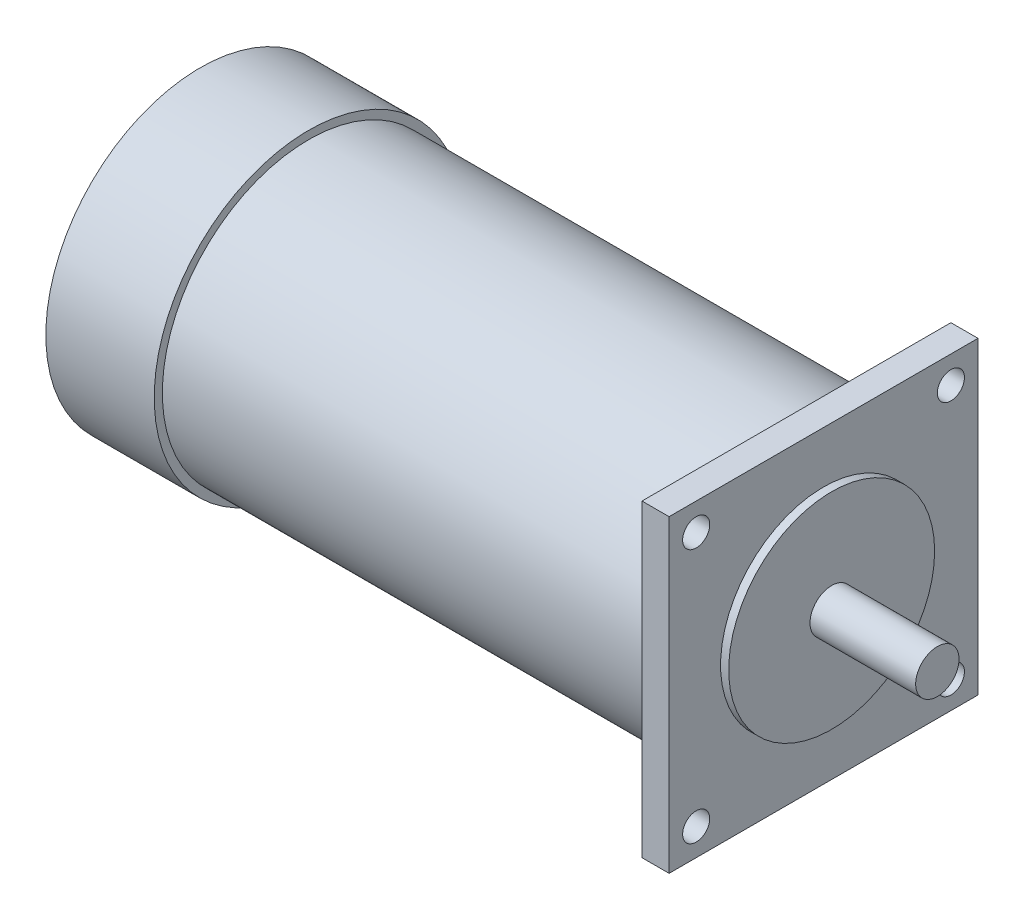
ISO-10303-21;
HEADER;
FILE_DESCRIPTION(('STEP AP214'),'2;1');
FILE_NAME('part.step','',(''),(''),'','','');
FILE_SCHEMA(('AUTOMOTIVE_DESIGN { 1 0 10303 214 1 1 1 1 }'));
ENDSEC;
DATA;
#1=APPLICATION_CONTEXT('core data for automotive mechanical design processes');
#2=APPLICATION_PROTOCOL_DEFINITION('international standard','automotive_design',2000,#1);
#3=PRODUCT_CONTEXT('',#1,'mechanical');
#4=PRODUCT('Part','Part','',(#3));
#5=PRODUCT_RELATED_PRODUCT_CATEGORY('part','',(#4));
#6=PRODUCT_DEFINITION_FORMATION('','',#4);
#7=PRODUCT_DEFINITION_CONTEXT('part definition',#1,'design');
#8=PRODUCT_DEFINITION('design','',#6,#7);
#9=PRODUCT_DEFINITION_SHAPE('','',#8);
#10=(LENGTH_UNIT() NAMED_UNIT(*) SI_UNIT(.MILLI.,.METRE.));
#11=(NAMED_UNIT(*) PLANE_ANGLE_UNIT() SI_UNIT($,.RADIAN.));
#12=(NAMED_UNIT(*) SI_UNIT($,.STERADIAN.) SOLID_ANGLE_UNIT());
#13=UNCERTAINTY_MEASURE_WITH_UNIT(LENGTH_MEASURE(1.E-05),#10,'distance_accuracy_value','');
#14=(GEOMETRIC_REPRESENTATION_CONTEXT(3) GLOBAL_UNCERTAINTY_ASSIGNED_CONTEXT((#13)) GLOBAL_UNIT_ASSIGNED_CONTEXT((#10,
#11,#12)) REPRESENTATION_CONTEXT('',''));
#15=CARTESIAN_POINT('',(0.,0.,0.));
#16=DIRECTION('',(0.,0.,1.));
#17=DIRECTION('',(1.,0.,0.));
#18=AXIS2_PLACEMENT_3D('',#15,#16,#17);
#19=CARTESIAN_POINT('',(-115.,-28.5,0.));
#20=DIRECTION('',(0.,-1.,0.));
#21=DIRECTION('',(0.,0.,-1.));
#22=AXIS2_PLACEMENT_3D('',#19,#20,#21);
#23=PLANE('',#22);
#24=DIRECTION('',(0.,0.,1.));
#25=VECTOR('',#24,1.);
#26=CARTESIAN_POINT('',(-5.,-28.5,0.));
#27=LINE('',#26,#25);
#28=CARTESIAN_POINT('',(-5.,-28.5,-28.5));
#29=VERTEX_POINT('',#28);
#30=CARTESIAN_POINT('',(-5.,-28.5,28.5));
#31=VERTEX_POINT('',#30);
#32=EDGE_CURVE('E88',#29,#31,#27,.T.);
#33=ORIENTED_EDGE('',*,*,#32,.F.);
#34=DIRECTION('',(1.,0.,0.));
#35=VECTOR('',#34,1.);
#36=CARTESIAN_POINT('',(-115.,-28.5,-28.5));
#37=LINE('',#36,#35);
#38=CARTESIAN_POINT('',(0.,-28.5,-28.5));
#39=VERTEX_POINT('',#38);
#40=EDGE_CURVE('E94',#29,#39,#37,.T.);
#41=ORIENTED_EDGE('',*,*,#40,.T.);
#42=DIRECTION('',(0.,0.,-1.));
#43=VECTOR('',#42,1.);
#44=CARTESIAN_POINT('',(0.,-28.5,0.));
#45=LINE('',#44,#43);
#46=CARTESIAN_POINT('',(0.,-28.5,28.5));
#47=VERTEX_POINT('',#46);
#48=EDGE_CURVE('E122',#47,#39,#45,.T.);
#49=ORIENTED_EDGE('',*,*,#48,.F.);
#50=DIRECTION('',(1.,0.,0.));
#51=VECTOR('',#50,1.);
#52=CARTESIAN_POINT('',(-115.,-28.5,28.5));
#53=LINE('',#52,#51);
#54=EDGE_CURVE('E68',#31,#47,#53,.T.);
#55=ORIENTED_EDGE('',*,*,#54,.F.);
#56=EDGE_LOOP('',(#33,#41,#49,#55));
#57=FACE_BOUND('',#56,.T.);
#58=ADVANCED_FACE('F46',(#57),#23,.T.);
#59=CARTESIAN_POINT('',(-115.,0.,28.5));
#60=DIRECTION('',(0.,0.,-1.));
#61=DIRECTION('',(-1.,0.,0.));
#62=AXIS2_PLACEMENT_3D('',#59,#60,#61);
#63=PLANE('',#62);
#64=DIRECTION('',(1.,0.,0.));
#65=VECTOR('',#64,1.);
#66=CARTESIAN_POINT('',(-115.,28.5,28.5));
#67=LINE('',#66,#65);
#68=CARTESIAN_POINT('',(-5.,28.5,28.5));
#69=VERTEX_POINT('',#68);
#70=CARTESIAN_POINT('',(0.,28.5,28.5));
#71=VERTEX_POINT('',#70);
#72=EDGE_CURVE('E106',#69,#71,#67,.T.);
#73=ORIENTED_EDGE('',*,*,#72,.F.);
#74=DIRECTION('',(0.,-1.,0.));
#75=VECTOR('',#74,1.);
#76=CARTESIAN_POINT('',(-5.,0.,28.5));
#77=LINE('',#76,#75);
#78=EDGE_CURVE('E97',#69,#31,#77,.T.);
#79=ORIENTED_EDGE('',*,*,#78,.T.);
#80=ORIENTED_EDGE('',*,*,#54,.T.);
#81=DIRECTION('',(0.,1.,0.));
#82=VECTOR('',#81,1.);
#83=CARTESIAN_POINT('',(0.,0.,28.5));
#84=LINE('',#83,#82);
#85=EDGE_CURVE('E109',#47,#71,#84,.T.);
#86=ORIENTED_EDGE('',*,*,#85,.T.);
#87=EDGE_LOOP('',(#73,#79,#80,#86));
#88=FACE_BOUND('',#87,.T.);
#89=ADVANCED_FACE('F187',(#88),#63,.F.);
#90=CARTESIAN_POINT('',(-115.,28.5,0.));
#91=DIRECTION('',(0.,-1.,0.));
#92=DIRECTION('',(0.,0.,-1.));
#93=AXIS2_PLACEMENT_3D('',#90,#91,#92);
#94=PLANE('',#93);
#95=DIRECTION('',(1.,0.,0.));
#96=VECTOR('',#95,1.);
#97=CARTESIAN_POINT('',(-115.,28.5,-28.5));
#98=LINE('',#97,#96);
#99=CARTESIAN_POINT('',(-5.,28.5,-28.5));
#100=VERTEX_POINT('',#99);
#101=CARTESIAN_POINT('',(0.,28.5,-28.5));
#102=VERTEX_POINT('',#101);
#103=EDGE_CURVE('E103',#100,#102,#98,.T.);
#104=ORIENTED_EDGE('',*,*,#103,.F.);
#105=DIRECTION('',(0.,0.,1.));
#106=VECTOR('',#105,1.);
#107=CARTESIAN_POINT('',(-5.,28.5,0.));
#108=LINE('',#107,#106);
#109=EDGE_CURVE('E60',#100,#69,#108,.T.);
#110=ORIENTED_EDGE('',*,*,#109,.T.);
#111=ORIENTED_EDGE('',*,*,#72,.T.);
#112=DIRECTION('',(0.,0.,-1.));
#113=VECTOR('',#112,1.);
#114=CARTESIAN_POINT('',(0.,28.5,0.));
#115=LINE('',#114,#113);
#116=EDGE_CURVE('E118',#71,#102,#115,.T.);
#117=ORIENTED_EDGE('',*,*,#116,.T.);
#118=EDGE_LOOP('',(#104,#110,#111,#117));
#119=FACE_BOUND('',#118,.T.);
#120=ADVANCED_FACE('F189',(#119),#94,.F.);
#121=CARTESIAN_POINT('',(-115.,0.,0.));
#122=DIRECTION('',(1.,0.,0.));
#123=DIRECTION('',(0.,0.,-1.));
#124=AXIS2_PLACEMENT_3D('',#121,#122,#123);
#125=CYLINDRICAL_SURFACE('',#124,19.);
#126=CARTESIAN_POINT('',(-115.,0.,0.));
#127=DIRECTION('',(1.,0.,0.));
#128=DIRECTION('',(0.,0.,-1.));
#129=AXIS2_PLACEMENT_3D('',#126,#127,#128);
#130=CIRCLE('',#129,19.);
#131=CARTESIAN_POINT('',(-115.,0.,-19.));
#132=VERTEX_POINT('',#131);
#133=EDGE_CURVE('E104',#132,#132,#130,.T.);
#134=ORIENTED_EDGE('',*,*,#133,.F.);
#135=EDGE_LOOP('',(#134));
#136=FACE_BOUND('',#135,.T.);
#137=CARTESIAN_POINT('',(0.,0.,0.));
#138=DIRECTION('',(1.,0.,0.));
#139=DIRECTION('',(0.,0.,-1.));
#140=AXIS2_PLACEMENT_3D('',#137,#138,#139);
#141=CIRCLE('',#140,19.);
#142=CARTESIAN_POINT('',(0.,0.,-19.));
#143=VERTEX_POINT('',#142);
#144=EDGE_CURVE('E124',#143,#143,#141,.T.);
#145=ORIENTED_EDGE('',*,*,#144,.T.);
#146=EDGE_LOOP('',(#145));
#147=FACE_BOUND('',#146,.T.);
#148=ADVANCED_FACE('F48',(#136,#147),#125,.F.);
#149=CARTESIAN_POINT('',(-115.,0.,-28.5));
#150=DIRECTION('',(0.,0.,-1.));
#151=DIRECTION('',(-1.,0.,0.));
#152=AXIS2_PLACEMENT_3D('',#149,#150,#151);
#153=PLANE('',#152);
#154=DIRECTION('',(0.,-1.,0.));
#155=VECTOR('',#154,1.);
#156=CARTESIAN_POINT('',(-5.,0.,-28.5));
#157=LINE('',#156,#155);
#158=EDGE_CURVE('E13',#100,#29,#157,.T.);
#159=ORIENTED_EDGE('',*,*,#158,.F.);
#160=ORIENTED_EDGE('',*,*,#103,.T.);
#161=DIRECTION('',(0.,1.,0.));
#162=VECTOR('',#161,1.);
#163=CARTESIAN_POINT('',(0.,0.,-28.5));
#164=LINE('',#163,#162);
#165=EDGE_CURVE('E101',#39,#102,#164,.T.);
#166=ORIENTED_EDGE('',*,*,#165,.F.);
#167=ORIENTED_EDGE('',*,*,#40,.F.);
#168=EDGE_LOOP('',(#159,#160,#166,#167));
#169=FACE_BOUND('',#168,.T.);
#170=ADVANCED_FACE('F99',(#169),#153,.T.);
#171=CARTESIAN_POINT('',(-115.,0.,0.));
#172=DIRECTION('',(1.,0.,0.));
#173=DIRECTION('',(0.,0.,-1.));
#174=AXIS2_PLACEMENT_3D('',#171,#172,#173);
#175=PLANE('',#174);
#176=ORIENTED_EDGE('',*,*,#133,.T.);
#177=EDGE_LOOP('',(#176));
#178=FACE_BOUND('',#177,.T.);
#179=CARTESIAN_POINT('',(-115.,0.,0.));
#180=DIRECTION('',(1.,0.,0.));
#181=DIRECTION('',(0.,0.,-1.));
#182=AXIS2_PLACEMENT_3D('',#179,#180,#181);
#183=CIRCLE('',#182,28.5);
#184=CARTESIAN_POINT('',(-115.,0.,-28.5));
#185=VERTEX_POINT('',#184);
#186=EDGE_CURVE('E54',#185,#185,#183,.F.);
#187=ORIENTED_EDGE('',*,*,#186,.T.);
#188=EDGE_LOOP('',(#187));
#189=FACE_BOUND('',#188,.T.);
#190=ADVANCED_FACE('F175',(#178,#189),#175,.F.);
#191=CARTESIAN_POINT('',(0.,0.,0.));
#192=DIRECTION('',(1.,0.,0.));
#193=DIRECTION('',(0.,0.,-1.));
#194=AXIS2_PLACEMENT_3D('',#191,#192,#193);
#195=PLANE('',#194);
#196=CARTESIAN_POINT('',(0.,-23.5,23.4999999999987));
#197=DIRECTION('',(1.,0.,0.));
#198=DIRECTION('',(0.,0.,-1.));
#199=AXIS2_PLACEMENT_3D('',#196,#197,#198);
#200=CIRCLE('',#199,2.5000000000007);
#201=CARTESIAN_POINT('',(0.,-23.5,20.999999999998));
#202=VERTEX_POINT('',#201);
#203=EDGE_CURVE('E156',#202,#202,#200,.T.);
#204=ORIENTED_EDGE('',*,*,#203,.F.);
#205=EDGE_LOOP('',(#204));
#206=FACE_BOUND('',#205,.T.);
#207=CARTESIAN_POINT('',(0.,-23.4999999999987,-23.5000000000013));
#208=DIRECTION('',(1.,0.,0.));
#209=DIRECTION('',(0.,0.,-1.));
#210=AXIS2_PLACEMENT_3D('',#207,#208,#209);
#211=CIRCLE('',#210,2.50000000000188);
#212=CARTESIAN_POINT('',(0.,-23.4999999999987,-26.0000000000032));
#213=VERTEX_POINT('',#212);
#214=EDGE_CURVE('E150',#213,#213,#211,.T.);
#215=ORIENTED_EDGE('',*,*,#214,.F.);
#216=EDGE_LOOP('',(#215));
#217=FACE_BOUND('',#216,.T.);
#218=CARTESIAN_POINT('',(0.,23.5000000000013,-23.5));
#219=DIRECTION('',(1.,0.,0.));
#220=DIRECTION('',(0.,0.,-1.));
#221=AXIS2_PLACEMENT_3D('',#218,#219,#220);
#222=CIRCLE('',#221,2.50000000000137);
#223=CARTESIAN_POINT('',(0.,23.5000000000013,-26.0000000000014));
#224=VERTEX_POINT('',#223);
#225=EDGE_CURVE('E144',#224,#224,#222,.T.);
#226=ORIENTED_EDGE('',*,*,#225,.F.);
#227=EDGE_LOOP('',(#226));
#228=FACE_BOUND('',#227,.T.);
#229=CARTESIAN_POINT('',(0.,23.5,23.5));
#230=DIRECTION('',(1.,0.,0.));
#231=DIRECTION('',(0.,0.,-1.));
#232=AXIS2_PLACEMENT_3D('',#229,#230,#231);
#233=CIRCLE('',#232,2.5);
#234=CARTESIAN_POINT('',(0.,23.5,21.));
#235=VERTEX_POINT('',#234);
#236=EDGE_CURVE('E138',#235,#235,#233,.T.);
#237=ORIENTED_EDGE('',*,*,#236,.F.);
#238=EDGE_LOOP('',(#237));
#239=FACE_BOUND('',#238,.T.);
#240=ORIENTED_EDGE('',*,*,#144,.F.);
#241=EDGE_LOOP('',(#240));
#242=FACE_BOUND('',#241,.T.);
#243=ORIENTED_EDGE('',*,*,#48,.T.);
#244=ORIENTED_EDGE('',*,*,#165,.T.);
#245=ORIENTED_EDGE('',*,*,#116,.F.);
#246=ORIENTED_EDGE('',*,*,#85,.F.);
#247=EDGE_LOOP('',(#243,#244,#245,#246));
#248=FACE_BOUND('',#247,.T.);
#249=ADVANCED_FACE('F171',(#206,#217,#228,#239,#242,#248),#195,.T.);
#250=CARTESIAN_POINT('',(-95.,0.,0.));
#251=DIRECTION('',(-1.,0.,0.));
#252=DIRECTION('',(0.,0.,1.));
#253=AXIS2_PLACEMENT_3D('',#250,#251,#252);
#254=CYLINDRICAL_SURFACE('',#253,28.5);
#255=CARTESIAN_POINT('',(-95.,0.,0.));
#256=DIRECTION('',(1.,0.,0.));
#257=DIRECTION('',(0.,0.,-1.));
#258=AXIS2_PLACEMENT_3D('',#255,#256,#257);
#259=CIRCLE('',#258,28.5);
#260=CARTESIAN_POINT('',(-95.,0.,-28.5));
#261=VERTEX_POINT('',#260);
#262=EDGE_CURVE('E96',#261,#261,#259,.T.);
#263=ORIENTED_EDGE('',*,*,#262,.F.);
#264=EDGE_LOOP('',(#263));
#265=FACE_BOUND('',#264,.T.);
#266=ORIENTED_EDGE('',*,*,#186,.F.);
#267=EDGE_LOOP('',(#266));
#268=FACE_BOUND('',#267,.T.);
#269=ADVANCED_FACE('F174',(#265,#268),#254,.T.);
#270=CARTESIAN_POINT('',(-95.,0.,0.));
#271=DIRECTION('',(1.,0.,0.));
#272=DIRECTION('',(0.,0.,-1.));
#273=AXIS2_PLACEMENT_3D('',#270,#271,#272);
#274=PLANE('',#273);
#275=CARTESIAN_POINT('',(-95.,0.,0.));
#276=DIRECTION('',(1.,0.,0.));
#277=DIRECTION('',(0.,0.,-1.));
#278=AXIS2_PLACEMENT_3D('',#275,#276,#277);
#279=CIRCLE('',#278,27.);
#280=CARTESIAN_POINT('',(-95.,0.,-27.));
#281=VERTEX_POINT('',#280);
#282=EDGE_CURVE('E132',#281,#281,#279,.T.);
#283=ORIENTED_EDGE('',*,*,#282,.F.);
#284=EDGE_LOOP('',(#283));
#285=FACE_BOUND('',#284,.T.);
#286=ORIENTED_EDGE('',*,*,#262,.T.);
#287=EDGE_LOOP('',(#286));
#288=FACE_BOUND('',#287,.T.);
#289=ADVANCED_FACE('F213',(#285,#288),#274,.T.);
#290=CARTESIAN_POINT('',(-5.,0.,0.));
#291=DIRECTION('',(1.,0.,0.));
#292=DIRECTION('',(0.,0.,-1.));
#293=AXIS2_PLACEMENT_3D('',#290,#291,#292);
#294=PLANE('',#293);
#295=CARTESIAN_POINT('',(-5.,-23.5,23.4999999999987));
#296=DIRECTION('',(1.,0.,0.));
#297=DIRECTION('',(0.,0.,-1.));
#298=AXIS2_PLACEMENT_3D('',#295,#296,#297);
#299=CIRCLE('',#298,2.5000000000007);
#300=CARTESIAN_POINT('',(-5.,-23.5,20.999999999998));
#301=VERTEX_POINT('',#300);
#302=EDGE_CURVE('E153',#301,#301,#299,.T.);
#303=ORIENTED_EDGE('',*,*,#302,.T.);
#304=EDGE_LOOP('',(#303));
#305=FACE_BOUND('',#304,.T.);
#306=CARTESIAN_POINT('',(-5.,-23.4999999999987,-23.5000000000013));
#307=DIRECTION('',(1.,0.,0.));
#308=DIRECTION('',(0.,0.,-1.));
#309=AXIS2_PLACEMENT_3D('',#306,#307,#308);
#310=CIRCLE('',#309,2.50000000000188);
#311=CARTESIAN_POINT('',(-5.,-23.4999999999987,-26.0000000000032));
#312=VERTEX_POINT('',#311);
#313=EDGE_CURVE('E147',#312,#312,#310,.T.);
#314=ORIENTED_EDGE('',*,*,#313,.T.);
#315=EDGE_LOOP('',(#314));
#316=FACE_BOUND('',#315,.T.);
#317=CARTESIAN_POINT('',(-5.,23.5000000000013,-23.5));
#318=DIRECTION('',(1.,0.,0.));
#319=DIRECTION('',(0.,0.,-1.));
#320=AXIS2_PLACEMENT_3D('',#317,#318,#319);
#321=CIRCLE('',#320,2.50000000000137);
#322=CARTESIAN_POINT('',(-5.,23.5000000000013,-26.0000000000014));
#323=VERTEX_POINT('',#322);
#324=EDGE_CURVE('E141',#323,#323,#321,.T.);
#325=ORIENTED_EDGE('',*,*,#324,.T.);
#326=EDGE_LOOP('',(#325));
#327=FACE_BOUND('',#326,.T.);
#328=CARTESIAN_POINT('',(-5.,23.5,23.5));
#329=DIRECTION('',(1.,0.,0.));
#330=DIRECTION('',(0.,0.,-1.));
#331=AXIS2_PLACEMENT_3D('',#328,#329,#330);
#332=CIRCLE('',#331,2.5);
#333=CARTESIAN_POINT('',(-5.,23.5,21.));
#334=VERTEX_POINT('',#333);
#335=EDGE_CURVE('E135',#334,#334,#332,.T.);
#336=ORIENTED_EDGE('',*,*,#335,.T.);
#337=EDGE_LOOP('',(#336));
#338=FACE_BOUND('',#337,.T.);
#339=ORIENTED_EDGE('',*,*,#32,.T.);
#340=ORIENTED_EDGE('',*,*,#78,.F.);
#341=ORIENTED_EDGE('',*,*,#109,.F.);
#342=ORIENTED_EDGE('',*,*,#158,.T.);
#343=EDGE_LOOP('',(#339,#340,#341,#342));
#344=FACE_BOUND('',#343,.T.);
#345=CARTESIAN_POINT('',(-5.,0.,0.));
#346=DIRECTION('',(1.,0.,0.));
#347=DIRECTION('',(0.,0.,-1.));
#348=AXIS2_PLACEMENT_3D('',#345,#346,#347);
#349=CIRCLE('',#348,27.);
#350=CARTESIAN_POINT('',(-5.,0.,-27.));
#351=VERTEX_POINT('',#350);
#352=EDGE_CURVE('E131',#351,#351,#349,.T.);
#353=ORIENTED_EDGE('',*,*,#352,.T.);
#354=EDGE_LOOP('',(#353));
#355=FACE_BOUND('',#354,.T.);
#356=ADVANCED_FACE('F86',(#305,#316,#327,#338,#344,#355),#294,.F.);
#357=CARTESIAN_POINT('',(-5.,0.,0.));
#358=DIRECTION('',(-1.,0.,0.));
#359=DIRECTION('',(0.,0.,1.));
#360=AXIS2_PLACEMENT_3D('',#357,#358,#359);
#361=CYLINDRICAL_SURFACE('',#360,27.);
#362=ORIENTED_EDGE('',*,*,#352,.F.);
#363=EDGE_LOOP('',(#362));
#364=FACE_BOUND('',#363,.T.);
#365=ORIENTED_EDGE('',*,*,#282,.T.);
#366=EDGE_LOOP('',(#365));
#367=FACE_BOUND('',#366,.T.);
#368=ADVANCED_FACE('F220',(#364,#367),#361,.T.);
#369=CARTESIAN_POINT('',(-5.,23.5,23.5));
#370=DIRECTION('',(1.,0.,0.));
#371=DIRECTION('',(0.,0.,-1.));
#372=AXIS2_PLACEMENT_3D('',#369,#370,#371);
#373=CYLINDRICAL_SURFACE('',#372,2.5);
#374=ORIENTED_EDGE('',*,*,#335,.F.);
#375=EDGE_LOOP('',(#374));
#376=FACE_BOUND('',#375,.T.);
#377=ORIENTED_EDGE('',*,*,#236,.T.);
#378=EDGE_LOOP('',(#377));
#379=FACE_BOUND('',#378,.T.);
#380=ADVANCED_FACE('F223',(#376,#379),#373,.F.);
#381=CARTESIAN_POINT('',(-5.,23.5000000000013,-23.5));
#382=DIRECTION('',(1.,0.,0.));
#383=DIRECTION('',(0.,0.,-1.));
#384=AXIS2_PLACEMENT_3D('',#381,#382,#383);
#385=CYLINDRICAL_SURFACE('',#384,2.50000000000137);
#386=ORIENTED_EDGE('',*,*,#324,.F.);
#387=EDGE_LOOP('',(#386));
#388=FACE_BOUND('',#387,.T.);
#389=ORIENTED_EDGE('',*,*,#225,.T.);
#390=EDGE_LOOP('',(#389));
#391=FACE_BOUND('',#390,.T.);
#392=ADVANCED_FACE('F227',(#388,#391),#385,.F.);
#393=CARTESIAN_POINT('',(-5.,-23.4999999999987,-23.5000000000013));
#394=DIRECTION('',(1.,0.,0.));
#395=DIRECTION('',(0.,0.,-1.));
#396=AXIS2_PLACEMENT_3D('',#393,#394,#395);
#397=CYLINDRICAL_SURFACE('',#396,2.50000000000188);
#398=ORIENTED_EDGE('',*,*,#313,.F.);
#399=EDGE_LOOP('',(#398));
#400=FACE_BOUND('',#399,.T.);
#401=ORIENTED_EDGE('',*,*,#214,.T.);
#402=EDGE_LOOP('',(#401));
#403=FACE_BOUND('',#402,.T.);
#404=ADVANCED_FACE('F167',(#400,#403),#397,.F.);
#405=CARTESIAN_POINT('',(-5.,-23.5,23.4999999999987));
#406=DIRECTION('',(1.,0.,0.));
#407=DIRECTION('',(0.,0.,-1.));
#408=AXIS2_PLACEMENT_3D('',#405,#406,#407);
#409=CYLINDRICAL_SURFACE('',#408,2.5000000000007);
#410=ORIENTED_EDGE('',*,*,#302,.F.);
#411=EDGE_LOOP('',(#410));
#412=FACE_BOUND('',#411,.T.);
#413=ORIENTED_EDGE('',*,*,#203,.T.);
#414=EDGE_LOOP('',(#413));
#415=FACE_BOUND('',#414,.T.);
#416=ADVANCED_FACE('F164',(#412,#415),#409,.F.);
#417=CLOSED_SHELL('',(#58,#89,#120,#148,#170,#190,#249,#269,#289,#356,#368,#380,#392,#404,#416));
#418=MANIFOLD_SOLID_BREP('B2',#417);
#419=CARTESIAN_POINT('',(21.,0.,0.));
#420=DIRECTION('',(-1.,0.,0.));
#421=DIRECTION('',(0.,0.,1.));
#422=AXIS2_PLACEMENT_3D('',#419,#420,#421);
#423=CYLINDRICAL_SURFACE('',#422,4.);
#424=CARTESIAN_POINT('',(1.5,0.,0.));
#425=DIRECTION('',(1.,0.,0.));
#426=DIRECTION('',(0.,0.,-1.));
#427=AXIS2_PLACEMENT_3D('',#424,#425,#426);
#428=CIRCLE('',#427,4.);
#429=CARTESIAN_POINT('',(1.5,0.,-4.00000000000001));
#430=VERTEX_POINT('',#429);
#431=EDGE_CURVE('E344',#430,#430,#428,.T.);
#432=ORIENTED_EDGE('',*,*,#431,.T.);
#433=EDGE_LOOP('',(#432));
#434=FACE_BOUND('',#433,.T.);
#435=CARTESIAN_POINT('',(21.,0.,0.));
#436=DIRECTION('',(1.,0.,0.));
#437=DIRECTION('',(0.,0.,-1.));
#438=AXIS2_PLACEMENT_3D('',#435,#436,#437);
#439=CIRCLE('',#438,4.);
#440=CARTESIAN_POINT('',(21.,0.,-4.00000000000001));
#441=VERTEX_POINT('',#440);
#442=EDGE_CURVE('E45',#441,#441,#439,.T.);
#443=ORIENTED_EDGE('',*,*,#442,.F.);
#444=EDGE_LOOP('',(#443));
#445=FACE_BOUND('',#444,.T.);
#446=ADVANCED_FACE('F334',(#434,#445),#423,.T.);
#447=CARTESIAN_POINT('',(21.,0.,0.));
#448=DIRECTION('',(1.,0.,0.));
#449=DIRECTION('',(0.,0.,-1.));
#450=AXIS2_PLACEMENT_3D('',#447,#448,#449);
#451=PLANE('',#450);
#452=ORIENTED_EDGE('',*,*,#442,.T.);
#453=EDGE_LOOP('',(#452));
#454=FACE_BOUND('',#453,.T.);
#455=ADVANCED_FACE('F366',(#454),#451,.T.);
#456=CARTESIAN_POINT('',(1.5,0.,0.));
#457=DIRECTION('',(-1.,0.,0.));
#458=DIRECTION('',(0.,0.,1.));
#459=AXIS2_PLACEMENT_3D('',#456,#457,#458);
#460=CYLINDRICAL_SURFACE('',#459,19.);
#461=CARTESIAN_POINT('',(1.5,0.,0.));
#462=DIRECTION('',(1.,0.,0.));
#463=DIRECTION('',(0.,0.,-1.));
#464=AXIS2_PLACEMENT_3D('',#461,#462,#463);
#465=CIRCLE('',#464,19.);
#466=CARTESIAN_POINT('',(1.5,0.,-19.));
#467=VERTEX_POINT('',#466);
#468=EDGE_CURVE('E340',#467,#467,#465,.T.);
#469=ORIENTED_EDGE('',*,*,#468,.F.);
#470=EDGE_LOOP('',(#469));
#471=FACE_BOUND('',#470,.T.);
#472=CARTESIAN_POINT('',(0.,0.,0.));
#473=DIRECTION('',(1.,0.,0.));
#474=DIRECTION('',(0.,0.,-1.));
#475=AXIS2_PLACEMENT_3D('',#472,#473,#474);
#476=CIRCLE('',#475,19.);
#477=CARTESIAN_POINT('',(0.,0.,-19.));
#478=VERTEX_POINT('',#477);
#479=EDGE_CURVE('E349',#478,#478,#476,.T.);
#480=ORIENTED_EDGE('',*,*,#479,.T.);
#481=EDGE_LOOP('',(#480));
#482=FACE_BOUND('',#481,.T.);
#483=ADVANCED_FACE('F354',(#471,#482),#460,.T.);
#484=CARTESIAN_POINT('',(1.5,0.,0.));
#485=DIRECTION('',(1.,0.,0.));
#486=DIRECTION('',(0.,0.,-1.));
#487=AXIS2_PLACEMENT_3D('',#484,#485,#486);
#488=PLANE('',#487);
#489=ORIENTED_EDGE('',*,*,#431,.F.);
#490=EDGE_LOOP('',(#489));
#491=FACE_BOUND('',#490,.T.);
#492=ORIENTED_EDGE('',*,*,#468,.T.);
#493=EDGE_LOOP('',(#492));
#494=FACE_BOUND('',#493,.T.);
#495=ADVANCED_FACE('F358',(#491,#494),#488,.T.);
#496=CARTESIAN_POINT('',(0.,0.,0.));
#497=DIRECTION('',(1.,0.,0.));
#498=DIRECTION('',(0.,0.,-1.));
#499=AXIS2_PLACEMENT_3D('',#496,#497,#498);
#500=PLANE('',#499);
#501=ORIENTED_EDGE('',*,*,#479,.F.);
#502=EDGE_LOOP('',(#501));
#503=FACE_BOUND('',#502,.T.);
#504=ADVANCED_FACE('F356',(#503),#500,.F.);
#505=CLOSED_SHELL('',(#446,#455,#483,#495,#504));
#506=MANIFOLD_SOLID_BREP('B7',#505);
#507=ADVANCED_BREP_SHAPE_REPRESENTATION('',(#18,#418,#506),#14);
#508=SHAPE_DEFINITION_REPRESENTATION(#9,#507);
ENDSEC;
END-ISO-10303-21;
